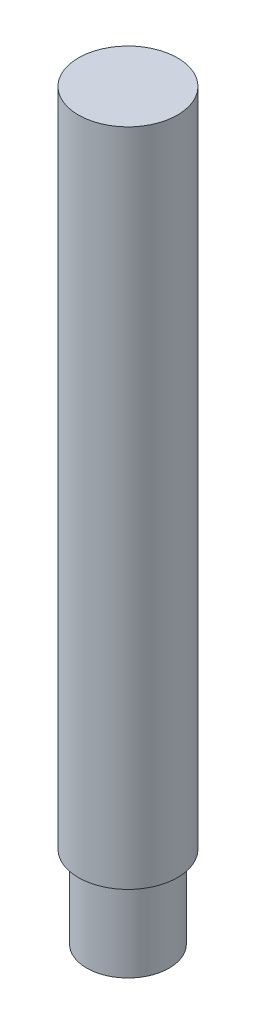
ISO-10303-21;
HEADER;
FILE_DESCRIPTION(('STEP AP214'),'2;1');
FILE_NAME('part.step','',(''),(''),'','','');
FILE_SCHEMA(('AUTOMOTIVE_DESIGN { 1 0 10303 214 1 1 1 1 }'));
ENDSEC;
DATA;
#1=APPLICATION_CONTEXT('core data for automotive mechanical design processes');
#2=APPLICATION_PROTOCOL_DEFINITION('international standard','automotive_design',2000,#1);
#3=PRODUCT_CONTEXT('',#1,'mechanical');
#4=PRODUCT('Part','Part','',(#3));
#5=PRODUCT_RELATED_PRODUCT_CATEGORY('part','',(#4));
#6=PRODUCT_DEFINITION_FORMATION('','',#4);
#7=PRODUCT_DEFINITION_CONTEXT('part definition',#1,'design');
#8=PRODUCT_DEFINITION('design','',#6,#7);
#9=PRODUCT_DEFINITION_SHAPE('','',#8);
#10=(LENGTH_UNIT() NAMED_UNIT(*) SI_UNIT(.MILLI.,.METRE.));
#11=(NAMED_UNIT(*) PLANE_ANGLE_UNIT() SI_UNIT($,.RADIAN.));
#12=(NAMED_UNIT(*) SI_UNIT($,.STERADIAN.) SOLID_ANGLE_UNIT());
#13=UNCERTAINTY_MEASURE_WITH_UNIT(LENGTH_MEASURE(1.E-05),#10,'distance_accuracy_value','');
#14=(GEOMETRIC_REPRESENTATION_CONTEXT(3) GLOBAL_UNCERTAINTY_ASSIGNED_CONTEXT((#13)) GLOBAL_UNIT_ASSIGNED_CONTEXT((#10,
#11,#12)) REPRESENTATION_CONTEXT('',''));
#15=CARTESIAN_POINT('',(0.,0.,0.));
#16=DIRECTION('',(0.,0.,1.));
#17=DIRECTION('',(1.,0.,0.));
#18=AXIS2_PLACEMENT_3D('',#15,#16,#17);
#19=CARTESIAN_POINT('',(0.,5.,0.));
#20=DIRECTION('',(0.,-1.,0.));
#21=DIRECTION('',(0.,0.,-1.));
#22=AXIS2_PLACEMENT_3D('',#19,#20,#21);
#23=CYLINDRICAL_SURFACE('',#22,2.5);
#24=CARTESIAN_POINT('',(0.,5.,0.));
#25=DIRECTION('',(0.,1.,0.));
#26=DIRECTION('',(0.,0.,1.));
#27=AXIS2_PLACEMENT_3D('',#24,#25,#26);
#28=CIRCLE('',#27,2.5);
#29=CARTESIAN_POINT('',(0.,5.,2.5));
#30=VERTEX_POINT('',#29);
#31=EDGE_CURVE('E10',#30,#30,#28,.T.);
#32=ORIENTED_EDGE('',*,*,#31,.F.);
#33=EDGE_LOOP('',(#32));
#34=FACE_BOUND('',#33,.T.);
#35=CARTESIAN_POINT('',(0.,0.,0.));
#36=DIRECTION('',(0.,1.,0.));
#37=DIRECTION('',(0.,0.,1.));
#38=AXIS2_PLACEMENT_3D('',#35,#36,#37);
#39=CIRCLE('',#38,2.5);
#40=CARTESIAN_POINT('',(0.,0.,2.5));
#41=VERTEX_POINT('',#40);
#42=EDGE_CURVE('E44',#41,#41,#39,.T.);
#43=ORIENTED_EDGE('',*,*,#42,.T.);
#44=EDGE_LOOP('',(#43));
#45=FACE_BOUND('',#44,.T.);
#46=ADVANCED_FACE('F41',(#34,#45),#23,.T.);
#47=CARTESIAN_POINT('',(0.,0.,0.));
#48=DIRECTION('',(0.,1.,0.));
#49=DIRECTION('',(0.,0.,1.));
#50=AXIS2_PLACEMENT_3D('',#47,#48,#49);
#51=PLANE('',#50);
#52=ORIENTED_EDGE('',*,*,#42,.F.);
#53=EDGE_LOOP('',(#52));
#54=FACE_BOUND('',#53,.T.);
#55=ADVANCED_FACE('F71',(#54),#51,.F.);
#56=CARTESIAN_POINT('',(0.,45.,0.));
#57=DIRECTION('',(0.,-1.,0.));
#58=DIRECTION('',(0.,0.,-1.));
#59=AXIS2_PLACEMENT_3D('',#56,#57,#58);
#60=CYLINDRICAL_SURFACE('',#59,3.);
#61=CARTESIAN_POINT('',(0.,45.,0.));
#62=DIRECTION('',(0.,1.,0.));
#63=DIRECTION('',(0.,0.,1.));
#64=AXIS2_PLACEMENT_3D('',#61,#62,#63);
#65=CIRCLE('',#64,3.);
#66=CARTESIAN_POINT('',(0.,45.,3.));
#67=VERTEX_POINT('',#66);
#68=EDGE_CURVE('E55',#67,#67,#65,.T.);
#69=ORIENTED_EDGE('',*,*,#68,.F.);
#70=EDGE_LOOP('',(#69));
#71=FACE_BOUND('',#70,.T.);
#72=CARTESIAN_POINT('',(0.,5.,0.));
#73=DIRECTION('',(0.,1.,0.));
#74=DIRECTION('',(0.,0.,1.));
#75=AXIS2_PLACEMENT_3D('',#72,#73,#74);
#76=CIRCLE('',#75,3.);
#77=CARTESIAN_POINT('',(0.,5.,3.));
#78=VERTEX_POINT('',#77);
#79=EDGE_CURVE('E57',#78,#78,#76,.T.);
#80=ORIENTED_EDGE('',*,*,#79,.T.);
#81=EDGE_LOOP('',(#80));
#82=FACE_BOUND('',#81,.T.);
#83=ADVANCED_FACE('F68',(#71,#82),#60,.T.);
#84=CARTESIAN_POINT('',(0.,45.,0.));
#85=DIRECTION('',(0.,1.,0.));
#86=DIRECTION('',(0.,0.,1.));
#87=AXIS2_PLACEMENT_3D('',#84,#85,#86);
#88=PLANE('',#87);
#89=ORIENTED_EDGE('',*,*,#68,.T.);
#90=EDGE_LOOP('',(#89));
#91=FACE_BOUND('',#90,.T.);
#92=ADVANCED_FACE('F66',(#91),#88,.T.);
#93=CARTESIAN_POINT('',(0.,5.,0.));
#94=DIRECTION('',(0.,1.,0.));
#95=DIRECTION('',(0.,0.,1.));
#96=AXIS2_PLACEMENT_3D('',#93,#94,#95);
#97=PLANE('',#96);
#98=ORIENTED_EDGE('',*,*,#31,.T.);
#99=EDGE_LOOP('',(#98));
#100=FACE_BOUND('',#99,.T.);
#101=ORIENTED_EDGE('',*,*,#79,.F.);
#102=EDGE_LOOP('',(#101));
#103=FACE_BOUND('',#102,.T.);
#104=ADVANCED_FACE('F75',(#100,#103),#97,.F.);
#105=CLOSED_SHELL('',(#46,#55,#83,#92,#104));
#106=MANIFOLD_SOLID_BREP('B2',#105);
#107=ADVANCED_BREP_SHAPE_REPRESENTATION('',(#18,#106),#14);
#108=SHAPE_DEFINITION_REPRESENTATION(#9,#107);
ENDSEC;
END-ISO-10303-21;
